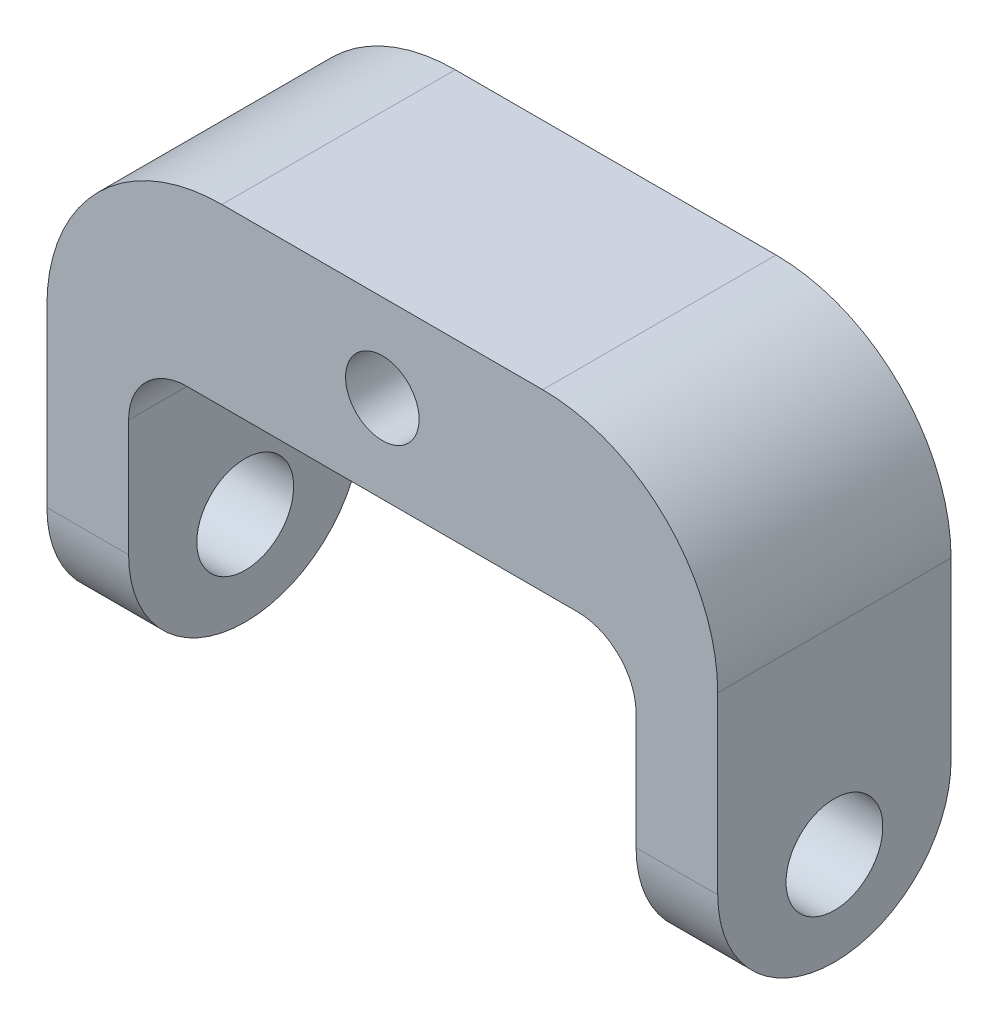
ISO-10303-21;
HEADER;
FILE_DESCRIPTION(('STEP AP214'),'2;1');
FILE_NAME('part.step','',(''),(''),'','','');
FILE_SCHEMA(('AUTOMOTIVE_DESIGN { 1 0 10303 214 1 1 1 1 }'));
ENDSEC;
DATA;
#1=APPLICATION_CONTEXT('core data for automotive mechanical design processes');
#2=APPLICATION_PROTOCOL_DEFINITION('international standard','automotive_design',2000,#1);
#3=PRODUCT_CONTEXT('',#1,'mechanical');
#4=PRODUCT('Part','Part','',(#3));
#5=PRODUCT_RELATED_PRODUCT_CATEGORY('part','',(#4));
#6=PRODUCT_DEFINITION_FORMATION('','',#4);
#7=PRODUCT_DEFINITION_CONTEXT('part definition',#1,'design');
#8=PRODUCT_DEFINITION('design','',#6,#7);
#9=PRODUCT_DEFINITION_SHAPE('','',#8);
#10=(LENGTH_UNIT() NAMED_UNIT(*) SI_UNIT(.MILLI.,.METRE.));
#11=(NAMED_UNIT(*) PLANE_ANGLE_UNIT() SI_UNIT($,.RADIAN.));
#12=(NAMED_UNIT(*) SI_UNIT($,.STERADIAN.) SOLID_ANGLE_UNIT());
#13=UNCERTAINTY_MEASURE_WITH_UNIT(LENGTH_MEASURE(1.E-05),#10,'distance_accuracy_value','');
#14=(GEOMETRIC_REPRESENTATION_CONTEXT(3) GLOBAL_UNCERTAINTY_ASSIGNED_CONTEXT((#13)) GLOBAL_UNIT_ASSIGNED_CONTEXT((#10,
#11,#12)) REPRESENTATION_CONTEXT('',''));
#15=CARTESIAN_POINT('',(0.,0.,0.));
#16=DIRECTION('',(0.,0.,1.));
#17=DIRECTION('',(1.,0.,0.));
#18=AXIS2_PLACEMENT_3D('',#15,#16,#17);
#19=CARTESIAN_POINT('',(28.75,-10.,0.));
#20=DIRECTION('',(1.,0.,0.));
#21=DIRECTION('',(0.,0.,-1.));
#22=AXIS2_PLACEMENT_3D('',#19,#20,#21);
#23=CYLINDRICAL_SURFACE('',#22,10.);
#24=DIRECTION('',(1.,0.,0.));
#25=VECTOR('',#24,1.);
#26=CARTESIAN_POINT('',(0.,-10.,-10.));
#27=LINE('',#26,#25);
#28=CARTESIAN_POINT('',(28.75,-10.,-10.));
#29=VERTEX_POINT('',#28);
#30=CARTESIAN_POINT('',(21.75,-10.,-10.));
#31=VERTEX_POINT('',#30);
#32=EDGE_CURVE('E203',#29,#31,#27,.F.);
#33=ORIENTED_EDGE('',*,*,#32,.F.);
#34=CARTESIAN_POINT('',(28.75,-10.,0.));
#35=DIRECTION('',(-1.,0.,0.));
#36=DIRECTION('',(0.,-1.,0.));
#37=AXIS2_PLACEMENT_3D('',#34,#35,#36);
#38=CIRCLE('',#37,10.);
#39=CARTESIAN_POINT('',(28.75,-10.,10.));
#40=VERTEX_POINT('',#39);
#41=EDGE_CURVE('E207',#40,#29,#38,.F.);
#42=ORIENTED_EDGE('',*,*,#41,.F.);
#43=DIRECTION('',(-1.,0.,0.));
#44=VECTOR('',#43,1.);
#45=CARTESIAN_POINT('',(28.75,-10.,10.));
#46=LINE('',#45,#44);
#47=CARTESIAN_POINT('',(21.75,-10.,10.));
#48=VERTEX_POINT('',#47);
#49=EDGE_CURVE('E138',#48,#40,#46,.F.);
#50=ORIENTED_EDGE('',*,*,#49,.F.);
#51=CARTESIAN_POINT('',(21.75,-10.,0.));
#52=DIRECTION('',(-1.,0.,0.));
#53=DIRECTION('',(0.,-1.,0.));
#54=AXIS2_PLACEMENT_3D('',#51,#52,#53);
#55=CIRCLE('',#54,10.);
#56=EDGE_CURVE('E209',#31,#48,#55,.T.);
#57=ORIENTED_EDGE('',*,*,#56,.F.);
#58=EDGE_LOOP('',(#33,#42,#50,#57));
#59=FACE_BOUND('',#58,.T.);
#60=ADVANCED_FACE('F37',(#59),#23,.T.);
#61=CARTESIAN_POINT('',(-21.75,-10.,0.));
#62=DIRECTION('',(1.,0.,0.));
#63=DIRECTION('',(0.,0.,-1.));
#64=AXIS2_PLACEMENT_3D('',#61,#62,#63);
#65=CYLINDRICAL_SURFACE('',#64,10.);
#66=DIRECTION('',(1.,0.,0.));
#67=VECTOR('',#66,1.);
#68=CARTESIAN_POINT('',(0.,-10.,-10.));
#69=LINE('',#68,#67);
#70=CARTESIAN_POINT('',(-21.75,-10.,-10.));
#71=VERTEX_POINT('',#70);
#72=CARTESIAN_POINT('',(-28.75,-10.,-10.));
#73=VERTEX_POINT('',#72);
#74=EDGE_CURVE('E150',#71,#73,#69,.F.);
#75=ORIENTED_EDGE('',*,*,#74,.F.);
#76=CARTESIAN_POINT('',(-21.75,-10.,0.));
#77=DIRECTION('',(-1.,0.,0.));
#78=DIRECTION('',(0.,-1.,0.));
#79=AXIS2_PLACEMENT_3D('',#76,#77,#78);
#80=CIRCLE('',#79,10.);
#81=CARTESIAN_POINT('',(-21.75,-10.,10.));
#82=VERTEX_POINT('',#81);
#83=EDGE_CURVE('E199',#82,#71,#80,.F.);
#84=ORIENTED_EDGE('',*,*,#83,.F.);
#85=DIRECTION('',(-1.,0.,0.));
#86=VECTOR('',#85,1.);
#87=CARTESIAN_POINT('',(-21.75,-10.,10.));
#88=LINE('',#87,#86);
#89=CARTESIAN_POINT('',(-28.75,-10.,10.));
#90=VERTEX_POINT('',#89);
#91=EDGE_CURVE('E196',#90,#82,#88,.F.);
#92=ORIENTED_EDGE('',*,*,#91,.F.);
#93=CARTESIAN_POINT('',(-28.75,-10.,0.));
#94=DIRECTION('',(-1.,0.,0.));
#95=DIRECTION('',(0.,-1.,0.));
#96=AXIS2_PLACEMENT_3D('',#93,#94,#95);
#97=CIRCLE('',#96,10.);
#98=EDGE_CURVE('E201',#73,#90,#97,.T.);
#99=ORIENTED_EDGE('',*,*,#98,.F.);
#100=EDGE_LOOP('',(#75,#84,#92,#99));
#101=FACE_BOUND('',#100,.T.);
#102=ADVANCED_FACE('F250',(#101),#65,.T.);
#103=CARTESIAN_POINT('',(-21.75,0.,10.));
#104=DIRECTION('',(-1.,0.,0.));
#105=DIRECTION('',(0.,-1.,0.));
#106=AXIS2_PLACEMENT_3D('',#103,#104,#105);
#107=PLANE('',#106);
#108=CARTESIAN_POINT('',(-21.75,-12.,0.));
#109=DIRECTION('',(-1.,0.,0.));
#110=DIRECTION('',(0.,-1.,0.));
#111=AXIS2_PLACEMENT_3D('',#108,#109,#110);
#112=CIRCLE('',#111,4.15);
#113=CARTESIAN_POINT('',(-21.75,-12.,4.15));
#114=VERTEX_POINT('',#113);
#115=EDGE_CURVE('E169',#114,#114,#112,.T.);
#116=ORIENTED_EDGE('',*,*,#115,.T.);
#117=EDGE_LOOP('',(#116));
#118=FACE_BOUND('',#117,.T.);
#119=DIRECTION('',(0.,1.,0.));
#120=VECTOR('',#119,1.);
#121=CARTESIAN_POINT('',(-21.75,0.,-10.));
#122=LINE('',#121,#120);
#123=CARTESIAN_POINT('',(-21.75,0.,-10.));
#124=VERTEX_POINT('',#123);
#125=EDGE_CURVE('E168',#71,#124,#122,.T.);
#126=ORIENTED_EDGE('',*,*,#125,.T.);
#127=DIRECTION('',(0.,0.,1.));
#128=VECTOR('',#127,1.);
#129=CARTESIAN_POINT('',(-21.75,0.,10.));
#130=LINE('',#129,#128);
#131=CARTESIAN_POINT('',(-21.75,0.,10.));
#132=VERTEX_POINT('',#131);
#133=EDGE_CURVE('E218',#124,#132,#130,.T.);
#134=ORIENTED_EDGE('',*,*,#133,.T.);
#135=DIRECTION('',(0.,1.,0.));
#136=VECTOR('',#135,1.);
#137=CARTESIAN_POINT('',(-21.75,0.,10.));
#138=LINE('',#137,#136);
#139=EDGE_CURVE('E227',#82,#132,#138,.T.);
#140=ORIENTED_EDGE('',*,*,#139,.F.);
#141=ORIENTED_EDGE('',*,*,#83,.T.);
#142=EDGE_LOOP('',(#126,#134,#140,#141));
#143=FACE_BOUND('',#142,.T.);
#144=ADVANCED_FACE('F233',(#118,#143),#107,.F.);
#145=CARTESIAN_POINT('',(0.,5.,10.));
#146=DIRECTION('',(0.,1.,0.));
#147=DIRECTION('',(0.,0.,1.));
#148=AXIS2_PLACEMENT_3D('',#145,#146,#147);
#149=PLANE('',#148);
#150=DIRECTION('',(1.,0.,0.));
#151=VECTOR('',#150,1.);
#152=CARTESIAN_POINT('',(0.,5.,-10.));
#153=LINE('',#152,#151);
#154=CARTESIAN_POINT('',(-16.75,5.,-10.));
#155=VERTEX_POINT('',#154);
#156=CARTESIAN_POINT('',(16.75,5.,-10.));
#157=VERTEX_POINT('',#156);
#158=EDGE_CURVE('E171',#155,#157,#153,.T.);
#159=ORIENTED_EDGE('',*,*,#158,.T.);
#160=DIRECTION('',(0.,0.,1.));
#161=VECTOR('',#160,1.);
#162=CARTESIAN_POINT('',(16.75,5.,10.));
#163=LINE('',#162,#161);
#164=CARTESIAN_POINT('',(16.75,5.,10.));
#165=VERTEX_POINT('',#164);
#166=EDGE_CURVE('E213',#157,#165,#163,.T.);
#167=ORIENTED_EDGE('',*,*,#166,.T.);
#168=DIRECTION('',(1.,0.,0.));
#169=VECTOR('',#168,1.);
#170=CARTESIAN_POINT('',(0.,5.,10.));
#171=LINE('',#170,#169);
#172=CARTESIAN_POINT('',(-16.75,5.,10.));
#173=VERTEX_POINT('',#172);
#174=EDGE_CURVE('E225',#173,#165,#171,.T.);
#175=ORIENTED_EDGE('',*,*,#174,.F.);
#176=DIRECTION('',(0.,0.,1.));
#177=VECTOR('',#176,1.);
#178=CARTESIAN_POINT('',(-16.75,5.,-10.));
#179=LINE('',#178,#177);
#180=EDGE_CURVE('E211',#173,#155,#179,.F.);
#181=ORIENTED_EDGE('',*,*,#180,.T.);
#182=EDGE_LOOP('',(#159,#167,#175,#181));
#183=FACE_BOUND('',#182,.T.);
#184=ADVANCED_FACE('F229',(#183),#149,.F.);
#185=CARTESIAN_POINT('',(21.75,0.,10.));
#186=DIRECTION('',(-1.,0.,0.));
#187=DIRECTION('',(0.,-1.,0.));
#188=AXIS2_PLACEMENT_3D('',#185,#186,#187);
#189=PLANE('',#188);
#190=CARTESIAN_POINT('',(21.75,-12.,0.));
#191=DIRECTION('',(-1.,0.,0.));
#192=DIRECTION('',(0.,-1.,0.));
#193=AXIS2_PLACEMENT_3D('',#190,#191,#192);
#194=CIRCLE('',#193,4.15);
#195=CARTESIAN_POINT('',(21.75,-12.,4.15));
#196=VERTEX_POINT('',#195);
#197=EDGE_CURVE('E292',#196,#196,#194,.T.);
#198=ORIENTED_EDGE('',*,*,#197,.F.);
#199=EDGE_LOOP('',(#198));
#200=FACE_BOUND('',#199,.T.);
#201=DIRECTION('',(0.,1.,0.));
#202=VECTOR('',#201,1.);
#203=CARTESIAN_POINT('',(21.75,0.,10.));
#204=LINE('',#203,#202);
#205=CARTESIAN_POINT('',(21.75,0.,10.));
#206=VERTEX_POINT('',#205);
#207=EDGE_CURVE('E140',#48,#206,#204,.T.);
#208=ORIENTED_EDGE('',*,*,#207,.T.);
#209=DIRECTION('',(0.,0.,1.));
#210=VECTOR('',#209,1.);
#211=CARTESIAN_POINT('',(21.75,0.,10.));
#212=LINE('',#211,#210);
#213=CARTESIAN_POINT('',(21.75,0.,-10.));
#214=VERTEX_POINT('',#213);
#215=EDGE_CURVE('E216',#206,#214,#212,.F.);
#216=ORIENTED_EDGE('',*,*,#215,.T.);
#217=DIRECTION('',(0.,1.,0.));
#218=VECTOR('',#217,1.);
#219=CARTESIAN_POINT('',(21.75,0.,-10.));
#220=LINE('',#219,#218);
#221=EDGE_CURVE('E174',#31,#214,#220,.T.);
#222=ORIENTED_EDGE('',*,*,#221,.F.);
#223=ORIENTED_EDGE('',*,*,#56,.T.);
#224=EDGE_LOOP('',(#208,#216,#222,#223));
#225=FACE_BOUND('',#224,.T.);
#226=ADVANCED_FACE('F285',(#200,#225),#189,.T.);
#227=CARTESIAN_POINT('',(28.75,0.,10.));
#228=DIRECTION('',(-1.,0.,0.));
#229=DIRECTION('',(0.,-1.,0.));
#230=AXIS2_PLACEMENT_3D('',#227,#228,#229);
#231=PLANE('',#230);
#232=CARTESIAN_POINT('',(28.75,-12.,0.));
#233=DIRECTION('',(-1.,0.,0.));
#234=DIRECTION('',(0.,0.,1.));
#235=AXIS2_PLACEMENT_3D('',#232,#233,#234);
#236=CIRCLE('',#235,4.15);
#237=CARTESIAN_POINT('',(28.75,-12.,4.15));
#238=VERTEX_POINT('',#237);
#239=EDGE_CURVE('E295',#238,#238,#236,.T.);
#240=ORIENTED_EDGE('',*,*,#239,.T.);
#241=EDGE_LOOP('',(#240));
#242=FACE_BOUND('',#241,.T.);
#243=DIRECTION('',(0.,1.,0.));
#244=VECTOR('',#243,1.);
#245=CARTESIAN_POINT('',(28.75,0.,10.));
#246=LINE('',#245,#244);
#247=CARTESIAN_POINT('',(28.75,5.,10.));
#248=VERTEX_POINT('',#247);
#249=EDGE_CURVE('E127',#40,#248,#246,.T.);
#250=ORIENTED_EDGE('',*,*,#249,.F.);
#251=ORIENTED_EDGE('',*,*,#41,.T.);
#252=DIRECTION('',(0.,1.,0.));
#253=VECTOR('',#252,1.);
#254=CARTESIAN_POINT('',(28.75,0.,-10.));
#255=LINE('',#254,#253);
#256=CARTESIAN_POINT('',(28.75,5.,-10.));
#257=VERTEX_POINT('',#256);
#258=EDGE_CURVE('E146',#29,#257,#255,.T.);
#259=ORIENTED_EDGE('',*,*,#258,.T.);
#260=DIRECTION('',(0.,0.,-1.));
#261=VECTOR('',#260,1.);
#262=CARTESIAN_POINT('',(28.75,5.,10.));
#263=LINE('',#262,#261);
#264=EDGE_CURVE('E143',#248,#257,#263,.T.);
#265=ORIENTED_EDGE('',*,*,#264,.F.);
#266=EDGE_LOOP('',(#250,#251,#259,#265));
#267=FACE_BOUND('',#266,.T.);
#268=ADVANCED_FACE('F144',(#242,#267),#231,.F.);
#269=CARTESIAN_POINT('',(13.75,5.,10.));
#270=DIRECTION('',(0.,0.,-1.));
#271=DIRECTION('',(-1.,0.,0.));
#272=AXIS2_PLACEMENT_3D('',#269,#270,#271);
#273=CYLINDRICAL_SURFACE('',#272,15.);
#274=CARTESIAN_POINT('',(13.75,5.,-10.));
#275=DIRECTION('',(0.,0.,1.));
#276=DIRECTION('',(1.,0.,0.));
#277=AXIS2_PLACEMENT_3D('',#274,#275,#276);
#278=CIRCLE('',#277,15.);
#279=CARTESIAN_POINT('',(13.75,20.,-10.));
#280=VERTEX_POINT('',#279);
#281=EDGE_CURVE('E178',#280,#257,#278,.F.);
#282=ORIENTED_EDGE('',*,*,#281,.F.);
#283=DIRECTION('',(0.,0.,-1.));
#284=VECTOR('',#283,1.);
#285=CARTESIAN_POINT('',(13.75,20.,10.));
#286=LINE('',#285,#284);
#287=CARTESIAN_POINT('',(13.75,20.,10.));
#288=VERTEX_POINT('',#287);
#289=EDGE_CURVE('E151',#288,#280,#286,.T.);
#290=ORIENTED_EDGE('',*,*,#289,.F.);
#291=CARTESIAN_POINT('',(13.75,5.,10.));
#292=DIRECTION('',(0.,0.,1.));
#293=DIRECTION('',(1.,0.,0.));
#294=AXIS2_PLACEMENT_3D('',#291,#292,#293);
#295=CIRCLE('',#294,15.);
#296=EDGE_CURVE('E134',#288,#248,#295,.F.);
#297=ORIENTED_EDGE('',*,*,#296,.T.);
#298=ORIENTED_EDGE('',*,*,#264,.T.);
#299=EDGE_LOOP('',(#282,#290,#297,#298));
#300=FACE_BOUND('',#299,.T.);
#301=ADVANCED_FACE('F153',(#300),#273,.T.);
#302=CARTESIAN_POINT('',(0.,20.,10.));
#303=DIRECTION('',(0.,1.,0.));
#304=DIRECTION('',(0.,0.,1.));
#305=AXIS2_PLACEMENT_3D('',#302,#303,#304);
#306=PLANE('',#305);
#307=DIRECTION('',(1.,0.,0.));
#308=VECTOR('',#307,1.);
#309=CARTESIAN_POINT('',(0.,20.,-10.));
#310=LINE('',#309,#308);
#311=CARTESIAN_POINT('',(-13.75,20.,-10.));
#312=VERTEX_POINT('',#311);
#313=EDGE_CURVE('E180',#312,#280,#310,.T.);
#314=ORIENTED_EDGE('',*,*,#313,.F.);
#315=DIRECTION('',(0.,0.,-1.));
#316=VECTOR('',#315,1.);
#317=CARTESIAN_POINT('',(-13.75,20.,10.));
#318=LINE('',#317,#316);
#319=CARTESIAN_POINT('',(-13.75,20.,10.));
#320=VERTEX_POINT('',#319);
#321=EDGE_CURVE('E191',#320,#312,#318,.T.);
#322=ORIENTED_EDGE('',*,*,#321,.F.);
#323=DIRECTION('',(1.,0.,0.));
#324=VECTOR('',#323,1.);
#325=CARTESIAN_POINT('',(0.,20.,10.));
#326=LINE('',#325,#324);
#327=EDGE_CURVE('E154',#320,#288,#326,.T.);
#328=ORIENTED_EDGE('',*,*,#327,.T.);
#329=ORIENTED_EDGE('',*,*,#289,.T.);
#330=EDGE_LOOP('',(#314,#322,#328,#329));
#331=FACE_BOUND('',#330,.T.);
#332=ADVANCED_FACE('F249',(#331),#306,.T.);
#333=CARTESIAN_POINT('',(-13.75,5.,10.));
#334=DIRECTION('',(0.,0.,-1.));
#335=DIRECTION('',(-1.,0.,0.));
#336=AXIS2_PLACEMENT_3D('',#333,#334,#335);
#337=CYLINDRICAL_SURFACE('',#336,15.);
#338=CARTESIAN_POINT('',(-13.75,5.,-10.));
#339=DIRECTION('',(0.,0.,1.));
#340=DIRECTION('',(1.,0.,0.));
#341=AXIS2_PLACEMENT_3D('',#338,#339,#340);
#342=CIRCLE('',#341,15.);
#343=CARTESIAN_POINT('',(-28.75,5.,-10.));
#344=VERTEX_POINT('',#343);
#345=EDGE_CURVE('E183',#344,#312,#342,.F.);
#346=ORIENTED_EDGE('',*,*,#345,.F.);
#347=DIRECTION('',(0.,0.,-1.));
#348=VECTOR('',#347,1.);
#349=CARTESIAN_POINT('',(-28.75,5.,10.));
#350=LINE('',#349,#348);
#351=CARTESIAN_POINT('',(-28.75,5.,10.));
#352=VERTEX_POINT('',#351);
#353=EDGE_CURVE('E164',#352,#344,#350,.T.);
#354=ORIENTED_EDGE('',*,*,#353,.F.);
#355=CARTESIAN_POINT('',(-13.75,5.,10.));
#356=DIRECTION('',(0.,0.,1.));
#357=DIRECTION('',(1.,0.,0.));
#358=AXIS2_PLACEMENT_3D('',#355,#356,#357);
#359=CIRCLE('',#358,15.);
#360=EDGE_CURVE('E156',#352,#320,#359,.F.);
#361=ORIENTED_EDGE('',*,*,#360,.T.);
#362=ORIENTED_EDGE('',*,*,#321,.T.);
#363=EDGE_LOOP('',(#346,#354,#361,#362));
#364=FACE_BOUND('',#363,.T.);
#365=ADVANCED_FACE('F246',(#364),#337,.T.);
#366=CARTESIAN_POINT('',(-28.75,0.,10.));
#367=DIRECTION('',(-1.,0.,0.));
#368=DIRECTION('',(0.,-1.,0.));
#369=AXIS2_PLACEMENT_3D('',#366,#367,#368);
#370=PLANE('',#369);
#371=CARTESIAN_POINT('',(-28.75,-12.,0.));
#372=DIRECTION('',(-1.,0.,0.));
#373=DIRECTION('',(0.,0.,1.));
#374=AXIS2_PLACEMENT_3D('',#371,#372,#373);
#375=CIRCLE('',#374,4.15);
#376=CARTESIAN_POINT('',(-28.75,-12.,4.15));
#377=VERTEX_POINT('',#376);
#378=EDGE_CURVE('E296',#377,#377,#375,.T.);
#379=ORIENTED_EDGE('',*,*,#378,.F.);
#380=EDGE_LOOP('',(#379));
#381=FACE_BOUND('',#380,.T.);
#382=DIRECTION('',(0.,1.,0.));
#383=VECTOR('',#382,1.);
#384=CARTESIAN_POINT('',(-28.75,0.,-10.));
#385=LINE('',#384,#383);
#386=EDGE_CURVE('E186',#73,#344,#385,.T.);
#387=ORIENTED_EDGE('',*,*,#386,.F.);
#388=ORIENTED_EDGE('',*,*,#98,.T.);
#389=DIRECTION('',(0.,1.,0.));
#390=VECTOR('',#389,1.);
#391=CARTESIAN_POINT('',(-28.75,0.,10.));
#392=LINE('',#391,#390);
#393=EDGE_CURVE('E162',#90,#352,#392,.T.);
#394=ORIENTED_EDGE('',*,*,#393,.T.);
#395=ORIENTED_EDGE('',*,*,#353,.T.);
#396=EDGE_LOOP('',(#387,#388,#394,#395));
#397=FACE_BOUND('',#396,.T.);
#398=ADVANCED_FACE('F239',(#381,#397),#370,.T.);
#399=CARTESIAN_POINT('',(0.,12.5,10.));
#400=DIRECTION('',(0.,0.,-1.));
#401=DIRECTION('',(-1.,0.,0.));
#402=AXIS2_PLACEMENT_3D('',#399,#400,#401);
#403=CYLINDRICAL_SURFACE('',#402,3.15);
#404=CARTESIAN_POINT('',(0.,12.5,10.));
#405=DIRECTION('',(0.,0.,1.));
#406=DIRECTION('',(1.,0.,0.));
#407=AXIS2_PLACEMENT_3D('',#404,#405,#406);
#408=CIRCLE('',#407,3.15);
#409=CARTESIAN_POINT('',(3.15,12.5,10.));
#410=VERTEX_POINT('',#409);
#411=EDGE_CURVE('E188',#410,#410,#408,.T.);
#412=ORIENTED_EDGE('',*,*,#411,.T.);
#413=EDGE_LOOP('',(#412));
#414=FACE_BOUND('',#413,.T.);
#415=CARTESIAN_POINT('',(0.,12.5,-10.));
#416=DIRECTION('',(0.,0.,1.));
#417=DIRECTION('',(1.,0.,0.));
#418=AXIS2_PLACEMENT_3D('',#415,#416,#417);
#419=CIRCLE('',#418,3.15);
#420=CARTESIAN_POINT('',(3.15,12.5,-10.));
#421=VERTEX_POINT('',#420);
#422=EDGE_CURVE('E165',#421,#421,#419,.T.);
#423=ORIENTED_EDGE('',*,*,#422,.F.);
#424=EDGE_LOOP('',(#423));
#425=FACE_BOUND('',#424,.T.);
#426=ADVANCED_FACE('F266',(#414,#425),#403,.F.);
#427=CARTESIAN_POINT('',(0.,0.,10.));
#428=DIRECTION('',(0.,0.,1.));
#429=DIRECTION('',(1.,0.,0.));
#430=AXIS2_PLACEMENT_3D('',#427,#428,#429);
#431=PLANE('',#430);
#432=ORIENTED_EDGE('',*,*,#139,.T.);
#433=CARTESIAN_POINT('',(-16.75,0.,10.));
#434=DIRECTION('',(0.,0.,1.));
#435=DIRECTION('',(1.,0.,0.));
#436=AXIS2_PLACEMENT_3D('',#433,#434,#435);
#437=CIRCLE('',#436,5.);
#438=EDGE_CURVE('E45',#132,#173,#437,.F.);
#439=ORIENTED_EDGE('',*,*,#438,.T.);
#440=ORIENTED_EDGE('',*,*,#174,.T.);
#441=CARTESIAN_POINT('',(16.75,0.,10.));
#442=DIRECTION('',(0.,0.,1.));
#443=DIRECTION('',(1.,0.,0.));
#444=AXIS2_PLACEMENT_3D('',#441,#442,#443);
#445=CIRCLE('',#444,5.);
#446=EDGE_CURVE('E220',#165,#206,#445,.F.);
#447=ORIENTED_EDGE('',*,*,#446,.T.);
#448=ORIENTED_EDGE('',*,*,#207,.F.);
#449=ORIENTED_EDGE('',*,*,#49,.T.);
#450=ORIENTED_EDGE('',*,*,#249,.T.);
#451=ORIENTED_EDGE('',*,*,#296,.F.);
#452=ORIENTED_EDGE('',*,*,#327,.F.);
#453=ORIENTED_EDGE('',*,*,#360,.F.);
#454=ORIENTED_EDGE('',*,*,#393,.F.);
#455=ORIENTED_EDGE('',*,*,#91,.T.);
#456=EDGE_LOOP('',(#432,#439,#440,#447,#448,#449,#450,#451,#452,#453,#454,#455));
#457=FACE_BOUND('',#456,.T.);
#458=ORIENTED_EDGE('',*,*,#411,.F.);
#459=EDGE_LOOP('',(#458));
#460=FACE_BOUND('',#459,.T.);
#461=ADVANCED_FACE('F130',(#457,#460),#431,.T.);
#462=CARTESIAN_POINT('',(0.,0.,-10.));
#463=DIRECTION('',(0.,0.,1.));
#464=DIRECTION('',(1.,0.,0.));
#465=AXIS2_PLACEMENT_3D('',#462,#463,#464);
#466=PLANE('',#465);
#467=ORIENTED_EDGE('',*,*,#422,.T.);
#468=EDGE_LOOP('',(#467));
#469=FACE_BOUND('',#468,.T.);
#470=ORIENTED_EDGE('',*,*,#221,.T.);
#471=CARTESIAN_POINT('',(16.75,0.,-10.));
#472=DIRECTION('',(0.,0.,1.));
#473=DIRECTION('',(1.,0.,0.));
#474=AXIS2_PLACEMENT_3D('',#471,#472,#473);
#475=CIRCLE('',#474,5.);
#476=EDGE_CURVE('E222',#214,#157,#475,.T.);
#477=ORIENTED_EDGE('',*,*,#476,.T.);
#478=ORIENTED_EDGE('',*,*,#158,.F.);
#479=CARTESIAN_POINT('',(-16.75,0.,-10.));
#480=DIRECTION('',(0.,0.,1.));
#481=DIRECTION('',(1.,0.,0.));
#482=AXIS2_PLACEMENT_3D('',#479,#480,#481);
#483=CIRCLE('',#482,5.);
#484=EDGE_CURVE('E11',#155,#124,#483,.T.);
#485=ORIENTED_EDGE('',*,*,#484,.T.);
#486=ORIENTED_EDGE('',*,*,#125,.F.);
#487=ORIENTED_EDGE('',*,*,#74,.T.);
#488=ORIENTED_EDGE('',*,*,#386,.T.);
#489=ORIENTED_EDGE('',*,*,#345,.T.);
#490=ORIENTED_EDGE('',*,*,#313,.T.);
#491=ORIENTED_EDGE('',*,*,#281,.T.);
#492=ORIENTED_EDGE('',*,*,#258,.F.);
#493=ORIENTED_EDGE('',*,*,#32,.T.);
#494=EDGE_LOOP('',(#470,#477,#478,#485,#486,#487,#488,#489,#490,#491,#492,#493));
#495=FACE_BOUND('',#494,.T.);
#496=ADVANCED_FACE('F235',(#469,#495),#466,.F.);
#497=CARTESIAN_POINT('',(16.75,0.,10.));
#498=DIRECTION('',(0.,0.,1.));
#499=DIRECTION('',(1.,0.,0.));
#500=AXIS2_PLACEMENT_3D('',#497,#498,#499);
#501=CYLINDRICAL_SURFACE('',#500,5.);
#502=ORIENTED_EDGE('',*,*,#476,.F.);
#503=ORIENTED_EDGE('',*,*,#215,.F.);
#504=ORIENTED_EDGE('',*,*,#446,.F.);
#505=ORIENTED_EDGE('',*,*,#166,.F.);
#506=EDGE_LOOP('',(#502,#503,#504,#505));
#507=FACE_BOUND('',#506,.T.);
#508=ADVANCED_FACE('F269',(#507),#501,.F.);
#509=CARTESIAN_POINT('',(-16.75,0.,10.));
#510=DIRECTION('',(0.,0.,-1.));
#511=DIRECTION('',(-1.,0.,0.));
#512=AXIS2_PLACEMENT_3D('',#509,#510,#511);
#513=CYLINDRICAL_SURFACE('',#512,5.);
#514=ORIENTED_EDGE('',*,*,#484,.F.);
#515=ORIENTED_EDGE('',*,*,#180,.F.);
#516=ORIENTED_EDGE('',*,*,#438,.F.);
#517=ORIENTED_EDGE('',*,*,#133,.F.);
#518=EDGE_LOOP('',(#514,#515,#516,#517));
#519=FACE_BOUND('',#518,.T.);
#520=ADVANCED_FACE('F39',(#519),#513,.F.);
#521=CARTESIAN_POINT('',(28.75,-12.,0.));
#522=DIRECTION('',(-1.,0.,0.));
#523=DIRECTION('',(0.,0.,1.));
#524=AXIS2_PLACEMENT_3D('',#521,#522,#523);
#525=CYLINDRICAL_SURFACE('',#524,4.15);
#526=CARTESIAN_POINT('',(-28.75,-12.,4.15));
#527=CARTESIAN_POINT('',(-28.6770833333333,-12.,4.15));
#528=CARTESIAN_POINT('',(-28.6041666666667,-12.,4.15));
#529=CARTESIAN_POINT('',(-28.4583333333333,-12.,4.15));
#530=CARTESIAN_POINT('',(-28.3854166666667,-12.,4.15));
#531=CARTESIAN_POINT('',(-28.2395833333333,-12.,4.15));
#532=CARTESIAN_POINT('',(-28.1666666666667,-12.,4.15));
#533=CARTESIAN_POINT('',(-28.0208333333333,-12.,4.15));
#534=CARTESIAN_POINT('',(-27.9479166666667,-12.,4.15));
#535=CARTESIAN_POINT('',(-27.8020833333333,-12.,4.15));
#536=CARTESIAN_POINT('',(-27.7291666666667,-12.,4.15));
#537=CARTESIAN_POINT('',(-27.5833333333333,-12.,4.15));
#538=CARTESIAN_POINT('',(-27.5104166666667,-12.,4.15));
#539=CARTESIAN_POINT('',(-27.3645833333333,-12.,4.15));
#540=CARTESIAN_POINT('',(-27.2916666666667,-12.,4.15));
#541=CARTESIAN_POINT('',(-27.1458333333333,-12.,4.15));
#542=CARTESIAN_POINT('',(-27.0729166666667,-12.,4.15));
#543=CARTESIAN_POINT('',(-26.9270833333333,-12.,4.15));
#544=CARTESIAN_POINT('',(-26.8541666666667,-12.,4.15));
#545=CARTESIAN_POINT('',(-26.7083333333333,-12.,4.15));
#546=CARTESIAN_POINT('',(-26.6354166666667,-12.,4.15));
#547=CARTESIAN_POINT('',(-26.4895833333333,-12.,4.15));
#548=CARTESIAN_POINT('',(-26.4166666666667,-12.,4.15));
#549=CARTESIAN_POINT('',(-26.2708333333333,-12.,4.15));
#550=CARTESIAN_POINT('',(-26.1979166666667,-12.,4.15));
#551=CARTESIAN_POINT('',(-26.0520833333333,-12.,4.15));
#552=CARTESIAN_POINT('',(-25.9791666666667,-12.,4.15));
#553=CARTESIAN_POINT('',(-25.8333333333333,-12.,4.15));
#554=CARTESIAN_POINT('',(-25.7604166666667,-12.,4.15));
#555=CARTESIAN_POINT('',(-25.6145833333333,-12.,4.15));
#556=CARTESIAN_POINT('',(-25.5416666666667,-12.,4.15));
#557=CARTESIAN_POINT('',(-25.3958333333333,-12.,4.15));
#558=CARTESIAN_POINT('',(-25.3229166666667,-12.,4.15));
#559=CARTESIAN_POINT('',(-25.1770833333333,-12.,4.15));
#560=CARTESIAN_POINT('',(-25.1041666666667,-12.,4.15));
#561=CARTESIAN_POINT('',(-24.9583333333333,-12.,4.15));
#562=CARTESIAN_POINT('',(-24.8854166666667,-12.,4.15));
#563=CARTESIAN_POINT('',(-24.7395833333333,-12.,4.15));
#564=CARTESIAN_POINT('',(-24.6666666666667,-12.,4.15));
#565=CARTESIAN_POINT('',(-24.5208333333333,-12.,4.15));
#566=CARTESIAN_POINT('',(-24.4479166666667,-12.,4.15));
#567=CARTESIAN_POINT('',(-24.3020833333333,-12.,4.15));
#568=CARTESIAN_POINT('',(-24.2291666666667,-12.,4.15));
#569=CARTESIAN_POINT('',(-24.0833333333333,-12.,4.15));
#570=CARTESIAN_POINT('',(-24.0104166666667,-12.,4.15));
#571=CARTESIAN_POINT('',(-23.8645833333333,-12.,4.15));
#572=CARTESIAN_POINT('',(-23.7916666666667,-12.,4.15));
#573=CARTESIAN_POINT('',(-23.6458333333333,-12.,4.15));
#574=CARTESIAN_POINT('',(-23.5729166666667,-12.,4.15));
#575=CARTESIAN_POINT('',(-23.4270833333333,-12.,4.15));
#576=CARTESIAN_POINT('',(-23.3541666666667,-12.,4.15));
#577=CARTESIAN_POINT('',(-23.2083333333333,-12.,4.15));
#578=CARTESIAN_POINT('',(-23.1354166666667,-12.,4.15));
#579=CARTESIAN_POINT('',(-22.9895833333333,-12.,4.15));
#580=CARTESIAN_POINT('',(-22.9166666666667,-12.,4.15));
#581=CARTESIAN_POINT('',(-22.7708333333333,-12.,4.15));
#582=CARTESIAN_POINT('',(-22.6979166666667,-12.,4.15));
#583=CARTESIAN_POINT('',(-22.5520833333333,-12.,4.15));
#584=CARTESIAN_POINT('',(-22.4791666666667,-12.,4.15));
#585=CARTESIAN_POINT('',(-22.3333333333333,-12.,4.15));
#586=CARTESIAN_POINT('',(-22.2604166666667,-12.,4.15));
#587=CARTESIAN_POINT('',(-22.1145833333333,-12.,4.15));
#588=CARTESIAN_POINT('',(-22.0416666666667,-12.,4.15));
#589=CARTESIAN_POINT('',(-21.8958333333333,-12.,4.15));
#590=CARTESIAN_POINT('',(-21.8229166666667,-12.,4.15));
#591=CARTESIAN_POINT('',(-21.75,-12.,4.15));
#592=B_SPLINE_CURVE_WITH_KNOTS('',3,(#526,#527,#528,#529,#530,#531,#532,#533,#534,#535,#536,
#537,#538,#539,#540,#541,#542,#543,#544,#545,#546,#547,#548,#549,#550,#551,#552,#553,#554,#555,
#556,#557,#558,#559,#560,#561,#562,#563,#564,#565,#566,#567,#568,#569,#570,#571,#572,#573,#574,
#575,#576,#577,#578,#579,#580,#581,#582,#583,#584,#585,#586,#587,#588,#589,#590,#591),
.UNSPECIFIED.,.F.,.F.,(4,2,2,2,2,2,2,2,2,2,2,2,2,2,2,2,2,2,2,2,2,2,2,2,2,2,2,2,2,2,2,2,4),(0.,
0.218749999999997,0.4375,0.656249999999997,0.875000000000001,1.09375,1.3125,1.53125,1.75,
1.96875,2.1875,2.40625,2.625,2.84375,3.0625,3.28125,3.5,3.71874999999999,3.9375,
4.15624999999999,4.375,4.59374999999999,4.8125,5.03124999999999,5.24999999999999,
5.46874999999999,5.68749999999999,5.90624999999999,6.12499999999999,6.34375,6.56249999999999,
6.78124999999999,6.99999999999999),.UNSPECIFIED.);
#593=EDGE_CURVE('BSEAM276',#377,#114,#592,.T.);
#594=ORIENTED_EDGE('',*,*,#378,.T.);
#595=ORIENTED_EDGE('',*,*,#115,.F.);
#596=ORIENTED_EDGE('',*,*,#593,.T.);
#597=ORIENTED_EDGE('',*,*,#593,.F.);
#598=EDGE_LOOP('',(#594,#596,#595,#597));
#599=FACE_BOUND('',#598,.T.);
#600=ADVANCED_FACE('F276',(#599),#525,.F.);
#601=CARTESIAN_POINT('',(21.75,-12.,4.15));
#602=CARTESIAN_POINT('',(21.8229166666667,-12.,4.15));
#603=CARTESIAN_POINT('',(21.8958333333333,-12.,4.15));
#604=CARTESIAN_POINT('',(22.0416666666667,-12.,4.15));
#605=CARTESIAN_POINT('',(22.1145833333333,-12.,4.15));
#606=CARTESIAN_POINT('',(22.2604166666667,-12.,4.15));
#607=CARTESIAN_POINT('',(22.3333333333333,-12.,4.15));
#608=CARTESIAN_POINT('',(22.4791666666667,-12.,4.15));
#609=CARTESIAN_POINT('',(22.5520833333333,-12.,4.15));
#610=CARTESIAN_POINT('',(22.6979166666667,-12.,4.15));
#611=CARTESIAN_POINT('',(22.7708333333333,-12.,4.15));
#612=CARTESIAN_POINT('',(22.9166666666667,-12.,4.15));
#613=CARTESIAN_POINT('',(22.9895833333333,-12.,4.15));
#614=CARTESIAN_POINT('',(23.1354166666667,-12.,4.15));
#615=CARTESIAN_POINT('',(23.2083333333333,-12.,4.15));
#616=CARTESIAN_POINT('',(23.3541666666667,-12.,4.15));
#617=CARTESIAN_POINT('',(23.4270833333334,-12.,4.15));
#618=CARTESIAN_POINT('',(23.5729166666667,-12.,4.15));
#619=CARTESIAN_POINT('',(23.6458333333334,-12.,4.15));
#620=CARTESIAN_POINT('',(23.7916666666667,-12.,4.15));
#621=CARTESIAN_POINT('',(23.8645833333334,-12.,4.15));
#622=CARTESIAN_POINT('',(24.0104166666667,-12.,4.15));
#623=CARTESIAN_POINT('',(24.0833333333334,-12.,4.15));
#624=CARTESIAN_POINT('',(24.2291666666667,-12.,4.15));
#625=CARTESIAN_POINT('',(24.3020833333334,-12.,4.15));
#626=CARTESIAN_POINT('',(24.4479166666667,-12.,4.15));
#627=CARTESIAN_POINT('',(24.5208333333334,-12.,4.15));
#628=CARTESIAN_POINT('',(24.6666666666667,-12.,4.15));
#629=CARTESIAN_POINT('',(24.7395833333334,-12.,4.15));
#630=CARTESIAN_POINT('',(24.8854166666667,-12.,4.15));
#631=CARTESIAN_POINT('',(24.9583333333334,-12.,4.15));
#632=CARTESIAN_POINT('',(25.1041666666667,-12.,4.15));
#633=CARTESIAN_POINT('',(25.1770833333334,-12.,4.15));
#634=CARTESIAN_POINT('',(25.3229166666667,-12.,4.15));
#635=CARTESIAN_POINT('',(25.3958333333334,-12.,4.15));
#636=CARTESIAN_POINT('',(25.5416666666667,-12.,4.15));
#637=CARTESIAN_POINT('',(25.6145833333334,-12.,4.15));
#638=CARTESIAN_POINT('',(25.7604166666667,-12.,4.15));
#639=CARTESIAN_POINT('',(25.8333333333334,-12.,4.15));
#640=CARTESIAN_POINT('',(25.9791666666667,-12.,4.15));
#641=CARTESIAN_POINT('',(26.0520833333334,-12.,4.15));
#642=CARTESIAN_POINT('',(26.1979166666667,-12.,4.15));
#643=CARTESIAN_POINT('',(26.2708333333334,-12.,4.15));
#644=CARTESIAN_POINT('',(26.4166666666667,-12.,4.15));
#645=CARTESIAN_POINT('',(26.4895833333334,-12.,4.15));
#646=CARTESIAN_POINT('',(26.6354166666667,-12.,4.15));
#647=CARTESIAN_POINT('',(26.7083333333334,-12.,4.15));
#648=CARTESIAN_POINT('',(26.8541666666667,-12.,4.15));
#649=CARTESIAN_POINT('',(26.9270833333334,-12.,4.15));
#650=CARTESIAN_POINT('',(27.0729166666667,-12.,4.15));
#651=CARTESIAN_POINT('',(27.1458333333334,-12.,4.15));
#652=CARTESIAN_POINT('',(27.2916666666667,-12.,4.15));
#653=CARTESIAN_POINT('',(27.3645833333334,-12.,4.15));
#654=CARTESIAN_POINT('',(27.5104166666667,-12.,4.15));
#655=CARTESIAN_POINT('',(27.5833333333334,-12.,4.15));
#656=CARTESIAN_POINT('',(27.7291666666667,-12.,4.15));
#657=CARTESIAN_POINT('',(27.8020833333334,-12.,4.15));
#658=CARTESIAN_POINT('',(27.9479166666667,-12.,4.15));
#659=CARTESIAN_POINT('',(28.0208333333334,-12.,4.15));
#660=CARTESIAN_POINT('',(28.1666666666667,-12.,4.15));
#661=CARTESIAN_POINT('',(28.2395833333334,-12.,4.15));
#662=CARTESIAN_POINT('',(28.3854166666667,-12.,4.15));
#663=CARTESIAN_POINT('',(28.4583333333334,-12.,4.15));
#664=CARTESIAN_POINT('',(28.6041666666667,-12.,4.15));
#665=CARTESIAN_POINT('',(28.6770833333334,-12.,4.15));
#666=CARTESIAN_POINT('',(28.75,-12.,4.15));
#667=B_SPLINE_CURVE_WITH_KNOTS('',3,(#601,#602,#603,#604,#605,#606,#607,#608,#609,#610,#611,
#612,#613,#614,#615,#616,#617,#618,#619,#620,#621,#622,#623,#624,#625,#626,#627,#628,#629,#630,
#631,#632,#633,#634,#635,#636,#637,#638,#639,#640,#641,#642,#643,#644,#645,#646,#647,#648,#649,
#650,#651,#652,#653,#654,#655,#656,#657,#658,#659,#660,#661,#662,#663,#664,#665,#666),
.UNSPECIFIED.,.F.,.F.,(4,2,2,2,2,2,2,2,2,2,2,2,2,2,2,2,2,2,2,2,2,2,2,2,2,2,2,2,2,2,2,2,4),(0.,
0.21875,0.4375,0.656250000000001,0.875000000000001,1.09375,1.3125,1.53125,1.75,1.96875,2.1875,
2.40625,2.625,2.84375,3.0625,3.28125,3.5,3.71875,3.9375,4.15625,4.375,4.59375,4.8125,5.03125,
5.25,5.46875,5.68750000000001,5.90625000000001,6.12500000000001,6.34375000000001,
6.56250000000001,6.78125000000001,7.),.UNSPECIFIED.);
#668=EDGE_CURVE('BSEAM303',#196,#238,#667,.T.);
#669=ORIENTED_EDGE('',*,*,#197,.T.);
#670=ORIENTED_EDGE('',*,*,#239,.F.);
#671=ORIENTED_EDGE('',*,*,#668,.T.);
#672=ORIENTED_EDGE('',*,*,#668,.F.);
#673=EDGE_LOOP('',(#669,#671,#670,#672));
#674=FACE_BOUND('',#673,.T.);
#675=ADVANCED_FACE('F303',(#674),#525,.F.);
#676=CLOSED_SHELL('',(#60,#102,#144,#184,#226,#268,#301,#332,#365,#398,#426,#461,#496,#508,#520,
#600,#675));
#677=MANIFOLD_SOLID_BREP('B2',#676);
#678=ADVANCED_BREP_SHAPE_REPRESENTATION('',(#18,#677),#14);
#679=SHAPE_DEFINITION_REPRESENTATION(#9,#678);
ENDSEC;
END-ISO-10303-21;
